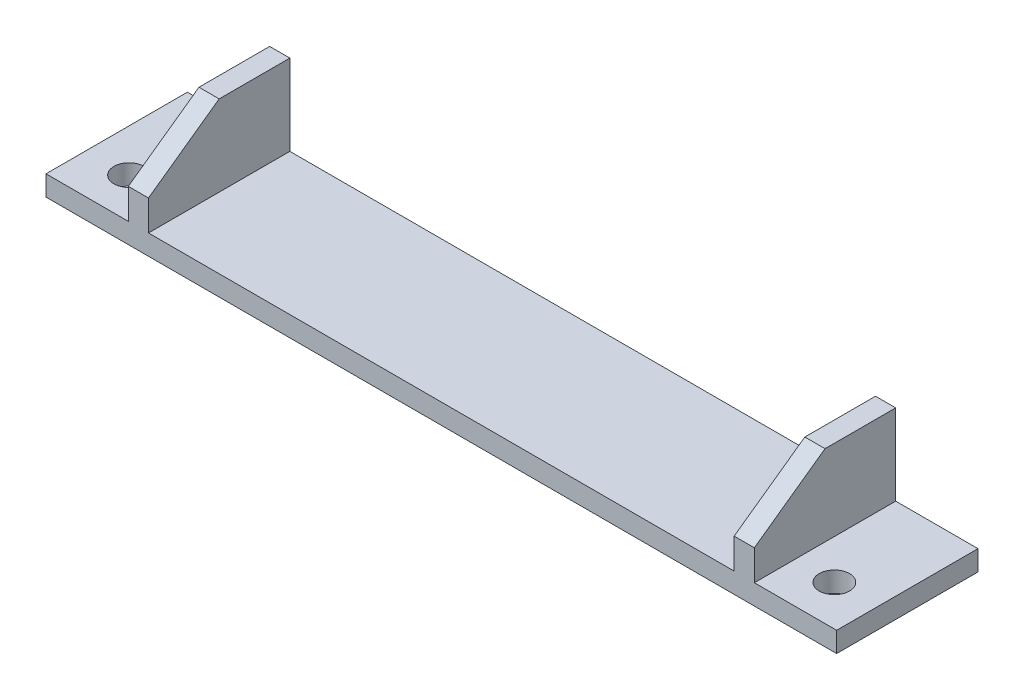
ISO-10303-21;
HEADER;
FILE_DESCRIPTION(('STEP AP214'),'2;1');
FILE_NAME('part.step','',(''),(''),'','','');
FILE_SCHEMA(('AUTOMOTIVE_DESIGN { 1 0 10303 214 1 1 1 1 }'));
ENDSEC;
DATA;
#1=APPLICATION_CONTEXT('core data for automotive mechanical design processes');
#2=APPLICATION_PROTOCOL_DEFINITION('international standard','automotive_design',2000,#1);
#3=PRODUCT_CONTEXT('',#1,'mechanical');
#4=PRODUCT('Part','Part','',(#3));
#5=PRODUCT_RELATED_PRODUCT_CATEGORY('part','',(#4));
#6=PRODUCT_DEFINITION_FORMATION('','',#4);
#7=PRODUCT_DEFINITION_CONTEXT('part definition',#1,'design');
#8=PRODUCT_DEFINITION('design','',#6,#7);
#9=PRODUCT_DEFINITION_SHAPE('','',#8);
#10=(LENGTH_UNIT() NAMED_UNIT(*) SI_UNIT(.MILLI.,.METRE.));
#11=(NAMED_UNIT(*) PLANE_ANGLE_UNIT() SI_UNIT($,.RADIAN.));
#12=(NAMED_UNIT(*) SI_UNIT($,.STERADIAN.) SOLID_ANGLE_UNIT());
#13=UNCERTAINTY_MEASURE_WITH_UNIT(LENGTH_MEASURE(1.E-05),#10,'distance_accuracy_value','');
#14=(GEOMETRIC_REPRESENTATION_CONTEXT(3) GLOBAL_UNCERTAINTY_ASSIGNED_CONTEXT((#13)) GLOBAL_UNIT_ASSIGNED_CONTEXT((#10,
#11,#12)) REPRESENTATION_CONTEXT('',''));
#15=CARTESIAN_POINT('',(0.,0.,0.));
#16=DIRECTION('',(0.,0.,1.));
#17=DIRECTION('',(1.,0.,0.));
#18=AXIS2_PLACEMENT_3D('',#15,#16,#17);
#19=CARTESIAN_POINT('',(0.,2.,0.));
#20=DIRECTION('',(0.,-1.,0.));
#21=DIRECTION('',(0.,0.,-1.));
#22=AXIS2_PLACEMENT_3D('',#19,#20,#21);
#23=PLANE('',#22);
#24=CARTESIAN_POINT('',(44.6246451696033,2.,-0.832823468273441));
#25=DIRECTION('',(0.,-1.,0.));
#26=DIRECTION('',(0.,0.,-1.));
#27=AXIS2_PLACEMENT_3D('',#24,#25,#26);
#28=CIRCLE('',#27,1.5);
#29=CARTESIAN_POINT('',(44.6246451696033,2.,-2.33282346827344));
#30=VERTEX_POINT('',#29);
#31=EDGE_CURVE('E293',#30,#30,#28,.T.);
#32=ORIENTED_EDGE('',*,*,#31,.T.);
#33=EDGE_LOOP('',(#32));
#34=FACE_BOUND('',#33,.T.);
#35=DIRECTION('',(0.,0.,-1.));
#36=VECTOR('',#35,1.);
#37=CARTESIAN_POINT('',(40.6996451696033,2.,-10.8328234682735));
#38=LINE('',#37,#36);
#39=CARTESIAN_POINT('',(40.6996451696033,2.,3.16717653172655));
#40=VERTEX_POINT('',#39);
#41=CARTESIAN_POINT('',(40.6996451696033,2.,-10.8328234682735));
#42=VERTEX_POINT('',#41);
#43=EDGE_CURVE('E224',#40,#42,#38,.T.);
#44=ORIENTED_EDGE('',*,*,#43,.F.);
#45=DIRECTION('',(1.,0.,0.));
#46=VECTOR('',#45,1.);
#47=CARTESIAN_POINT('',(-29.4503548303967,2.,3.16717653172655));
#48=LINE('',#47,#46);
#49=CARTESIAN_POINT('',(48.8496451696033,2.,3.16717653172654));
#50=VERTEX_POINT('',#49);
#51=EDGE_CURVE('E307',#40,#50,#48,.T.);
#52=ORIENTED_EDGE('',*,*,#51,.T.);
#53=DIRECTION('',(0.,0.,1.));
#54=VECTOR('',#53,1.);
#55=CARTESIAN_POINT('',(48.8496451696033,2.,-10.8328234682735));
#56=LINE('',#55,#54);
#57=CARTESIAN_POINT('',(48.8496451696033,2.,-10.8328234682735));
#58=VERTEX_POINT('',#57);
#59=EDGE_CURVE('E305',#58,#50,#56,.T.);
#60=ORIENTED_EDGE('',*,*,#59,.F.);
#61=DIRECTION('',(1.,0.,0.));
#62=VECTOR('',#61,1.);
#63=CARTESIAN_POINT('',(-29.4503548303967,2.,-10.8328234682734));
#64=LINE('',#63,#62);
#65=EDGE_CURVE('E310',#42,#58,#64,.T.);
#66=ORIENTED_EDGE('',*,*,#65,.F.);
#67=EDGE_LOOP('',(#44,#52,#60,#66));
#68=FACE_BOUND('',#67,.T.);
#69=ADVANCED_FACE('F43',(#34,#68),#23,.F.);
#70=DIRECTION('',(0.,0.,1.));
#71=VECTOR('',#70,1.);
#72=CARTESIAN_POINT('',(38.6996451696033,2.,-10.8328234682735));
#73=LINE('',#72,#71);
#74=CARTESIAN_POINT('',(38.6996451696033,2.,-10.8328234682735));
#75=VERTEX_POINT('',#74);
#76=CARTESIAN_POINT('',(38.6996451696033,2.,3.16717653172655));
#77=VERTEX_POINT('',#76);
#78=EDGE_CURVE('E369',#75,#77,#73,.T.);
#79=ORIENTED_EDGE('',*,*,#78,.F.);
#80=CARTESIAN_POINT('',(-19.3003548303967,2.,-10.8328234682734));
#81=VERTEX_POINT('',#80);
#82=EDGE_CURVE('E315',#81,#75,#64,.T.);
#83=ORIENTED_EDGE('',*,*,#82,.F.);
#84=DIRECTION('',(0.,0.,-1.));
#85=VECTOR('',#84,1.);
#86=CARTESIAN_POINT('',(-19.3003548303967,2.,-10.8328234682734));
#87=LINE('',#86,#85);
#88=CARTESIAN_POINT('',(-19.3003548303967,2.,3.16717653172655));
#89=VERTEX_POINT('',#88);
#90=EDGE_CURVE('E212',#89,#81,#87,.T.);
#91=ORIENTED_EDGE('',*,*,#90,.F.);
#92=EDGE_CURVE('E306',#89,#77,#48,.T.);
#93=ORIENTED_EDGE('',*,*,#92,.T.);
#94=EDGE_LOOP('',(#79,#83,#91,#93));
#95=FACE_BOUND('',#94,.T.);
#96=ADVANCED_FACE('F367',(#95),#23,.F.);
#97=CARTESIAN_POINT('',(-25.2253548303967,2.,-0.832823468273441));
#98=DIRECTION('',(0.,-1.,0.));
#99=DIRECTION('',(0.,0.,-1.));
#100=AXIS2_PLACEMENT_3D('',#97,#98,#99);
#101=CIRCLE('',#100,1.5);
#102=CARTESIAN_POINT('',(-25.2253548303967,2.,-2.33282346827344));
#103=VERTEX_POINT('',#102);
#104=EDGE_CURVE('E298',#103,#103,#101,.T.);
#105=ORIENTED_EDGE('',*,*,#104,.T.);
#106=EDGE_LOOP('',(#105));
#107=FACE_BOUND('',#106,.T.);
#108=DIRECTION('',(0.,0.,1.));
#109=VECTOR('',#108,1.);
#110=CARTESIAN_POINT('',(-21.3003548303967,2.,-10.8328234682734));
#111=LINE('',#110,#109);
#112=CARTESIAN_POINT('',(-21.3003548303967,2.,-10.8328234682734));
#113=VERTEX_POINT('',#112);
#114=CARTESIAN_POINT('',(-21.3003548303967,2.,3.16717653172655));
#115=VERTEX_POINT('',#114);
#116=EDGE_CURVE('E216',#113,#115,#111,.T.);
#117=ORIENTED_EDGE('',*,*,#116,.F.);
#118=CARTESIAN_POINT('',(-29.4503548303967,2.,-10.8328234682734));
#119=VERTEX_POINT('',#118);
#120=EDGE_CURVE('E311',#119,#113,#64,.T.);
#121=ORIENTED_EDGE('',*,*,#120,.F.);
#122=DIRECTION('',(0.,0.,1.));
#123=VECTOR('',#122,1.);
#124=CARTESIAN_POINT('',(-29.4503548303967,2.,-10.8328234682734));
#125=LINE('',#124,#123);
#126=CARTESIAN_POINT('',(-29.4503548303967,2.,3.16717653172655));
#127=VERTEX_POINT('',#126);
#128=EDGE_CURVE('E314',#119,#127,#125,.T.);
#129=ORIENTED_EDGE('',*,*,#128,.T.);
#130=EDGE_CURVE('E302',#127,#115,#48,.T.);
#131=ORIENTED_EDGE('',*,*,#130,.T.);
#132=EDGE_LOOP('',(#117,#121,#129,#131));
#133=FACE_BOUND('',#132,.T.);
#134=ADVANCED_FACE('F419',(#107,#133),#23,.F.);
#135=CARTESIAN_POINT('',(0.,0.,0.));
#136=DIRECTION('',(0.,-1.,0.));
#137=DIRECTION('',(0.,0.,-1.));
#138=AXIS2_PLACEMENT_3D('',#135,#136,#137);
#139=PLANE('',#138);
#140=CARTESIAN_POINT('',(-25.2253548303967,0.,-0.832823468273441));
#141=DIRECTION('',(0.,1.,0.));
#142=DIRECTION('',(0.,0.,1.));
#143=AXIS2_PLACEMENT_3D('',#140,#141,#142);
#144=CIRCLE('',#143,1.5);
#145=CARTESIAN_POINT('',(-25.2253548303967,0.,0.66717653172656));
#146=VERTEX_POINT('',#145);
#147=EDGE_CURVE('E290',#146,#146,#144,.T.);
#148=ORIENTED_EDGE('',*,*,#147,.T.);
#149=EDGE_LOOP('',(#148));
#150=FACE_BOUND('',#149,.T.);
#151=CARTESIAN_POINT('',(44.6246451696033,0.,-0.832823468273441));
#152=DIRECTION('',(0.,1.,0.));
#153=DIRECTION('',(0.,0.,1.));
#154=AXIS2_PLACEMENT_3D('',#151,#152,#153);
#155=CIRCLE('',#154,1.5);
#156=CARTESIAN_POINT('',(44.6246451696033,0.,0.667176531726563));
#157=VERTEX_POINT('',#156);
#158=EDGE_CURVE('E289',#157,#157,#155,.T.);
#159=ORIENTED_EDGE('',*,*,#158,.T.);
#160=EDGE_LOOP('',(#159));
#161=FACE_BOUND('',#160,.T.);
#162=DIRECTION('',(1.,0.,0.));
#163=VECTOR('',#162,1.);
#164=CARTESIAN_POINT('',(-29.4503548303967,0.,-10.8328234682734));
#165=LINE('',#164,#163);
#166=CARTESIAN_POINT('',(-9.50035483039672,0.,-10.8328234682734));
#167=VERTEX_POINT('',#166);
#168=CARTESIAN_POINT('',(28.8996451696033,0.,-10.8328234682734));
#169=VERTEX_POINT('',#168);
#170=EDGE_CURVE('E327',#167,#169,#165,.T.);
#171=ORIENTED_EDGE('',*,*,#170,.T.);
#172=DIRECTION('',(0.,0.,-1.));
#173=VECTOR('',#172,1.);
#174=CARTESIAN_POINT('',(28.8996451696033,0.,-10.8328234682734));
#175=LINE('',#174,#173);
#176=CARTESIAN_POINT('',(28.8996451696033,0.,-7.83282346827344));
#177=VERTEX_POINT('',#176);
#178=EDGE_CURVE('E249',#177,#169,#175,.T.);
#179=ORIENTED_EDGE('',*,*,#178,.F.);
#180=DIRECTION('',(-1.,0.,0.));
#181=VECTOR('',#180,1.);
#182=CARTESIAN_POINT('',(28.8996451696033,0.,-7.83282346827344));
#183=LINE('',#182,#181);
#184=CARTESIAN_POINT('',(31.8996451696033,0.,-7.83282346827344));
#185=VERTEX_POINT('',#184);
#186=EDGE_CURVE('E243',#185,#177,#183,.T.);
#187=ORIENTED_EDGE('',*,*,#186,.F.);
#188=DIRECTION('',(0.,0.,1.));
#189=VECTOR('',#188,1.);
#190=CARTESIAN_POINT('',(31.8996451696033,0.,-10.8328234682734));
#191=LINE('',#190,#189);
#192=CARTESIAN_POINT('',(31.8996451696033,0.,-10.8328234682734));
#193=VERTEX_POINT('',#192);
#194=EDGE_CURVE('E245',#193,#185,#191,.T.);
#195=ORIENTED_EDGE('',*,*,#194,.F.);
#196=CARTESIAN_POINT('',(48.8496451696033,0.,-10.8328234682735));
#197=VERTEX_POINT('',#196);
#198=EDGE_CURVE('E323',#193,#197,#165,.T.);
#199=ORIENTED_EDGE('',*,*,#198,.T.);
#200=DIRECTION('',(0.,0.,1.));
#201=VECTOR('',#200,1.);
#202=CARTESIAN_POINT('',(48.8496451696033,0.,-10.8328234682735));
#203=LINE('',#202,#201);
#204=CARTESIAN_POINT('',(48.8496451696033,0.,3.16717653172654));
#205=VERTEX_POINT('',#204);
#206=EDGE_CURVE('E320',#197,#205,#203,.T.);
#207=ORIENTED_EDGE('',*,*,#206,.T.);
#208=DIRECTION('',(1.,0.,0.));
#209=VECTOR('',#208,1.);
#210=CARTESIAN_POINT('',(-29.4503548303967,0.,3.16717653172655));
#211=LINE('',#210,#209);
#212=CARTESIAN_POINT('',(-29.4503548303967,0.,3.16717653172655));
#213=VERTEX_POINT('',#212);
#214=EDGE_CURVE('E301',#213,#205,#211,.T.);
#215=ORIENTED_EDGE('',*,*,#214,.F.);
#216=DIRECTION('',(0.,0.,1.));
#217=VECTOR('',#216,1.);
#218=CARTESIAN_POINT('',(-29.4503548303967,0.,-10.8328234682734));
#219=LINE('',#218,#217);
#220=CARTESIAN_POINT('',(-29.4503548303967,0.,-10.8328234682734));
#221=VERTEX_POINT('',#220);
#222=EDGE_CURVE('E326',#221,#213,#219,.T.);
#223=ORIENTED_EDGE('',*,*,#222,.F.);
#224=CARTESIAN_POINT('',(-12.5003548303967,0.,-10.8328234682734));
#225=VERTEX_POINT('',#224);
#226=EDGE_CURVE('E324',#221,#225,#165,.T.);
#227=ORIENTED_EDGE('',*,*,#226,.T.);
#228=DIRECTION('',(0.,0.,-1.));
#229=VECTOR('',#228,1.);
#230=CARTESIAN_POINT('',(-12.5003548303967,0.,-10.8328234682734));
#231=LINE('',#230,#229);
#232=CARTESIAN_POINT('',(-12.5003548303967,0.,-7.83282346827344));
#233=VERTEX_POINT('',#232);
#234=EDGE_CURVE('E264',#233,#225,#231,.T.);
#235=ORIENTED_EDGE('',*,*,#234,.F.);
#236=DIRECTION('',(-1.,0.,0.));
#237=VECTOR('',#236,1.);
#238=CARTESIAN_POINT('',(-9.50035483039672,0.,-7.83282346827344));
#239=LINE('',#238,#237);
#240=CARTESIAN_POINT('',(-9.50035483039672,0.,-7.83282346827344));
#241=VERTEX_POINT('',#240);
#242=EDGE_CURVE('E273',#241,#233,#239,.T.);
#243=ORIENTED_EDGE('',*,*,#242,.F.);
#244=DIRECTION('',(0.,0.,1.));
#245=VECTOR('',#244,1.);
#246=CARTESIAN_POINT('',(-9.50035483039672,0.,-10.8328234682734));
#247=LINE('',#246,#245);
#248=EDGE_CURVE('E252',#167,#241,#247,.T.);
#249=ORIENTED_EDGE('',*,*,#248,.F.);
#250=EDGE_LOOP('',(#171,#179,#187,#195,#199,#207,#215,#223,#227,#235,#243,#249));
#251=FACE_BOUND('',#250,.T.);
#252=ADVANCED_FACE('F350',(#150,#161,#251),#139,.T.);
#253=CARTESIAN_POINT('',(-29.4503548303967,2.,3.16717653172655));
#254=DIRECTION('',(0.,0.,-1.));
#255=DIRECTION('',(-1.,0.,0.));
#256=AXIS2_PLACEMENT_3D('',#253,#254,#255);
#257=PLANE('',#256);
#258=DIRECTION('',(0.,-1.,0.));
#259=VECTOR('',#258,1.);
#260=CARTESIAN_POINT('',(40.6996451696033,10.,3.16717653172655));
#261=LINE('',#260,#259);
#262=CARTESIAN_POINT('',(40.6996451696033,5.,3.16717653172655));
#263=VERTEX_POINT('',#262);
#264=EDGE_CURVE('E402',#263,#40,#261,.T.);
#265=ORIENTED_EDGE('',*,*,#264,.F.);
#266=DIRECTION('',(-1.,0.,0.));
#267=VECTOR('',#266,1.);
#268=CARTESIAN_POINT('',(48.8496451696033,5.,3.16717653172655));
#269=LINE('',#268,#267);
#270=CARTESIAN_POINT('',(38.6996451696033,5.,3.16717653172655));
#271=VERTEX_POINT('',#270);
#272=EDGE_CURVE('E375',#263,#271,#269,.T.);
#273=ORIENTED_EDGE('',*,*,#272,.T.);
#274=DIRECTION('',(0.,-1.,0.));
#275=VECTOR('',#274,1.);
#276=CARTESIAN_POINT('',(38.6996451696033,10.,3.16717653172655));
#277=LINE('',#276,#275);
#278=EDGE_CURVE('E374',#271,#77,#277,.T.);
#279=ORIENTED_EDGE('',*,*,#278,.T.);
#280=ORIENTED_EDGE('',*,*,#92,.F.);
#281=DIRECTION('',(0.,-1.,0.));
#282=VECTOR('',#281,1.);
#283=CARTESIAN_POINT('',(-19.3003548303967,10.,3.16717653172655));
#284=LINE('',#283,#282);
#285=CARTESIAN_POINT('',(-19.3003548303967,5.,3.16717653172655));
#286=VERTEX_POINT('',#285);
#287=EDGE_CURVE('E230',#286,#89,#284,.T.);
#288=ORIENTED_EDGE('',*,*,#287,.F.);
#289=CARTESIAN_POINT('',(-21.3003548303967,5.,3.16717653172655));
#290=VERTEX_POINT('',#289);
#291=EDGE_CURVE('E196',#286,#290,#269,.T.);
#292=ORIENTED_EDGE('',*,*,#291,.T.);
#293=DIRECTION('',(0.,-1.,0.));
#294=VECTOR('',#293,1.);
#295=CARTESIAN_POINT('',(-21.3003548303967,10.,3.16717653172655));
#296=LINE('',#295,#294);
#297=EDGE_CURVE('E205',#290,#115,#296,.T.);
#298=ORIENTED_EDGE('',*,*,#297,.T.);
#299=ORIENTED_EDGE('',*,*,#130,.F.);
#300=DIRECTION('',(0.,-1.,0.));
#301=VECTOR('',#300,1.);
#302=CARTESIAN_POINT('',(-29.4503548303967,2.,3.16717653172655));
#303=LINE('',#302,#301);
#304=EDGE_CURVE('E317',#127,#213,#303,.T.);
#305=ORIENTED_EDGE('',*,*,#304,.T.);
#306=ORIENTED_EDGE('',*,*,#214,.T.);
#307=DIRECTION('',(0.,-1.,0.));
#308=VECTOR('',#307,1.);
#309=CARTESIAN_POINT('',(48.8496451696033,2.,3.16717653172654));
#310=LINE('',#309,#308);
#311=EDGE_CURVE('E51',#50,#205,#310,.T.);
#312=ORIENTED_EDGE('',*,*,#311,.F.);
#313=ORIENTED_EDGE('',*,*,#51,.F.);
#314=EDGE_LOOP('',(#265,#273,#279,#280,#288,#292,#298,#299,#305,#306,#312,#313));
#315=FACE_BOUND('',#314,.T.);
#316=ADVANCED_FACE('F45',(#315),#257,.F.);
#317=CARTESIAN_POINT('',(48.8496451696033,2.,-10.8328234682735));
#318=DIRECTION('',(1.,0.,0.));
#319=DIRECTION('',(0.,0.,-1.));
#320=AXIS2_PLACEMENT_3D('',#317,#318,#319);
#321=PLANE('',#320);
#322=ORIENTED_EDGE('',*,*,#206,.F.);
#323=DIRECTION('',(0.,-1.,0.));
#324=VECTOR('',#323,1.);
#325=CARTESIAN_POINT('',(48.8496451696033,2.,-10.8328234682735));
#326=LINE('',#325,#324);
#327=EDGE_CURVE('E333',#58,#197,#326,.T.);
#328=ORIENTED_EDGE('',*,*,#327,.F.);
#329=ORIENTED_EDGE('',*,*,#59,.T.);
#330=ORIENTED_EDGE('',*,*,#311,.T.);
#331=EDGE_LOOP('',(#322,#328,#329,#330));
#332=FACE_BOUND('',#331,.T.);
#333=ADVANCED_FACE('F338',(#332),#321,.T.);
#334=CARTESIAN_POINT('',(-29.4503548303967,2.,-10.8328234682734));
#335=DIRECTION('',(0.,0.,-1.));
#336=DIRECTION('',(-1.,0.,0.));
#337=AXIS2_PLACEMENT_3D('',#334,#335,#336);
#338=PLANE('',#337);
#339=ORIENTED_EDGE('',*,*,#226,.F.);
#340=DIRECTION('',(0.,-1.,0.));
#341=VECTOR('',#340,1.);
#342=CARTESIAN_POINT('',(-29.4503548303967,2.,-10.8328234682734));
#343=LINE('',#342,#341);
#344=EDGE_CURVE('E331',#119,#221,#343,.T.);
#345=ORIENTED_EDGE('',*,*,#344,.F.);
#346=ORIENTED_EDGE('',*,*,#120,.T.);
#347=DIRECTION('',(0.,-1.,0.));
#348=VECTOR('',#347,1.);
#349=CARTESIAN_POINT('',(-21.3003548303967,10.,-10.8328234682734));
#350=LINE('',#349,#348);
#351=CARTESIAN_POINT('',(-21.3003548303967,10.,-10.8328234682734));
#352=VERTEX_POINT('',#351);
#353=EDGE_CURVE('E223',#352,#113,#350,.T.);
#354=ORIENTED_EDGE('',*,*,#353,.F.);
#355=DIRECTION('',(-1.,0.,0.));
#356=VECTOR('',#355,1.);
#357=CARTESIAN_POINT('',(-19.3003548303967,10.,-10.8328234682734));
#358=LINE('',#357,#356);
#359=CARTESIAN_POINT('',(-19.3003548303967,10.,-10.8328234682734));
#360=VERTEX_POINT('',#359);
#361=EDGE_CURVE('E209',#360,#352,#358,.T.);
#362=ORIENTED_EDGE('',*,*,#361,.F.);
#363=DIRECTION('',(0.,-1.,0.));
#364=VECTOR('',#363,1.);
#365=CARTESIAN_POINT('',(-19.3003548303967,10.,-10.8328234682734));
#366=LINE('',#365,#364);
#367=EDGE_CURVE('E227',#360,#81,#366,.T.);
#368=ORIENTED_EDGE('',*,*,#367,.T.);
#369=ORIENTED_EDGE('',*,*,#82,.T.);
#370=DIRECTION('',(0.,-1.,0.));
#371=VECTOR('',#370,1.);
#372=CARTESIAN_POINT('',(38.6996451696033,10.,-10.8328234682735));
#373=LINE('',#372,#371);
#374=CARTESIAN_POINT('',(38.6996451696033,10.,-10.8328234682735));
#375=VERTEX_POINT('',#374);
#376=EDGE_CURVE('E379',#375,#75,#373,.T.);
#377=ORIENTED_EDGE('',*,*,#376,.F.);
#378=DIRECTION('',(-1.,0.,0.));
#379=VECTOR('',#378,1.);
#380=CARTESIAN_POINT('',(38.6996451696033,10.,-10.8328234682735));
#381=LINE('',#380,#379);
#382=CARTESIAN_POINT('',(40.6996451696033,10.,-10.8328234682735));
#383=VERTEX_POINT('',#382);
#384=EDGE_CURVE('E386',#383,#375,#381,.T.);
#385=ORIENTED_EDGE('',*,*,#384,.F.);
#386=DIRECTION('',(0.,-1.,0.));
#387=VECTOR('',#386,1.);
#388=CARTESIAN_POINT('',(40.6996451696033,10.,-10.8328234682735));
#389=LINE('',#388,#387);
#390=EDGE_CURVE('E395',#383,#42,#389,.T.);
#391=ORIENTED_EDGE('',*,*,#390,.T.);
#392=ORIENTED_EDGE('',*,*,#65,.T.);
#393=ORIENTED_EDGE('',*,*,#327,.T.);
#394=ORIENTED_EDGE('',*,*,#198,.F.);
#395=DIRECTION('',(0.,1.,0.));
#396=VECTOR('',#395,1.);
#397=CARTESIAN_POINT('',(31.8996451696033,-2.,-10.8328234682734));
#398=LINE('',#397,#396);
#399=CARTESIAN_POINT('',(31.8996451696033,-2.,-10.8328234682734));
#400=VERTEX_POINT('',#399);
#401=EDGE_CURVE('E235',#400,#193,#398,.T.);
#402=ORIENTED_EDGE('',*,*,#401,.F.);
#403=DIRECTION('',(1.,0.,0.));
#404=VECTOR('',#403,1.);
#405=CARTESIAN_POINT('',(28.8996451696033,-2.,-10.8328234682734));
#406=LINE('',#405,#404);
#407=CARTESIAN_POINT('',(28.8996451696033,-2.,-10.8328234682734));
#408=VERTEX_POINT('',#407);
#409=EDGE_CURVE('E256',#408,#400,#406,.T.);
#410=ORIENTED_EDGE('',*,*,#409,.F.);
#411=DIRECTION('',(0.,1.,0.));
#412=VECTOR('',#411,1.);
#413=CARTESIAN_POINT('',(28.8996451696033,-2.,-10.8328234682734));
#414=LINE('',#413,#412);
#415=EDGE_CURVE('E233',#408,#169,#414,.T.);
#416=ORIENTED_EDGE('',*,*,#415,.T.);
#417=ORIENTED_EDGE('',*,*,#170,.F.);
#418=DIRECTION('',(0.,1.,0.));
#419=VECTOR('',#418,1.);
#420=CARTESIAN_POINT('',(-9.50035483039672,-2.,-10.8328234682734));
#421=LINE('',#420,#419);
#422=CARTESIAN_POINT('',(-9.50035483039672,-2.,-10.8328234682734));
#423=VERTEX_POINT('',#422);
#424=EDGE_CURVE('E270',#423,#167,#421,.T.);
#425=ORIENTED_EDGE('',*,*,#424,.F.);
#426=DIRECTION('',(1.,0.,0.));
#427=VECTOR('',#426,1.);
#428=CARTESIAN_POINT('',(-9.50035483039672,-2.,-10.8328234682734));
#429=LINE('',#428,#427);
#430=CARTESIAN_POINT('',(-12.5003548303967,-2.,-10.8328234682734));
#431=VERTEX_POINT('',#430);
#432=EDGE_CURVE('E268',#431,#423,#429,.T.);
#433=ORIENTED_EDGE('',*,*,#432,.F.);
#434=DIRECTION('',(0.,1.,0.));
#435=VECTOR('',#434,1.);
#436=CARTESIAN_POINT('',(-12.5003548303967,-2.,-10.8328234682734));
#437=LINE('',#436,#435);
#438=EDGE_CURVE('E280',#431,#225,#437,.T.);
#439=ORIENTED_EDGE('',*,*,#438,.T.);
#440=EDGE_LOOP('',(#339,#345,#346,#354,#362,#368,#369,#377,#385,#391,#392,#393,#394,#402,#410,
#416,#417,#425,#433,#439));
#441=FACE_BOUND('',#440,.T.);
#442=ADVANCED_FACE('F357',(#441),#338,.T.);
#443=CARTESIAN_POINT('',(-29.4503548303967,2.,-10.8328234682734));
#444=DIRECTION('',(1.,0.,0.));
#445=DIRECTION('',(0.,0.,-1.));
#446=AXIS2_PLACEMENT_3D('',#443,#444,#445);
#447=PLANE('',#446);
#448=ORIENTED_EDGE('',*,*,#222,.T.);
#449=ORIENTED_EDGE('',*,*,#304,.F.);
#450=ORIENTED_EDGE('',*,*,#128,.F.);
#451=ORIENTED_EDGE('',*,*,#344,.T.);
#452=EDGE_LOOP('',(#448,#449,#450,#451));
#453=FACE_BOUND('',#452,.T.);
#454=ADVANCED_FACE('F436',(#453),#447,.F.);
#455=CARTESIAN_POINT('',(44.6246451696033,0.,-0.832823468273441));
#456=DIRECTION('',(0.,1.,0.));
#457=DIRECTION('',(0.,0.,1.));
#458=AXIS2_PLACEMENT_3D('',#455,#456,#457);
#459=CYLINDRICAL_SURFACE('',#458,1.5);
#460=ORIENTED_EDGE('',*,*,#158,.F.);
#461=EDGE_LOOP('',(#460));
#462=FACE_BOUND('',#461,.T.);
#463=ORIENTED_EDGE('',*,*,#31,.F.);
#464=EDGE_LOOP('',(#463));
#465=FACE_BOUND('',#464,.T.);
#466=ADVANCED_FACE('F481',(#462,#465),#459,.F.);
#467=CARTESIAN_POINT('',(-25.2253548303967,0.,-0.832823468273441));
#468=DIRECTION('',(0.,1.,0.));
#469=DIRECTION('',(0.,0.,1.));
#470=AXIS2_PLACEMENT_3D('',#467,#468,#469);
#471=CYLINDRICAL_SURFACE('',#470,1.5);
#472=ORIENTED_EDGE('',*,*,#147,.F.);
#473=EDGE_LOOP('',(#472));
#474=FACE_BOUND('',#473,.T.);
#475=ORIENTED_EDGE('',*,*,#104,.F.);
#476=EDGE_LOOP('',(#475));
#477=FACE_BOUND('',#476,.T.);
#478=ADVANCED_FACE('F478',(#474,#477),#471,.F.);
#479=CARTESIAN_POINT('',(-9.50035483039672,-2.,-10.8328234682734));
#480=DIRECTION('',(-1.,0.,0.));
#481=DIRECTION('',(0.,0.,1.));
#482=AXIS2_PLACEMENT_3D('',#479,#480,#481);
#483=PLANE('',#482);
#484=ORIENTED_EDGE('',*,*,#248,.T.);
#485=DIRECTION('',(0.,1.,0.));
#486=VECTOR('',#485,1.);
#487=CARTESIAN_POINT('',(-9.50035483039672,-2.,-7.83282346827344));
#488=LINE('',#487,#486);
#489=CARTESIAN_POINT('',(-9.50035483039672,-2.,-7.83282346827344));
#490=VERTEX_POINT('',#489);
#491=EDGE_CURVE('E286',#490,#241,#488,.T.);
#492=ORIENTED_EDGE('',*,*,#491,.F.);
#493=DIRECTION('',(0.,0.,1.));
#494=VECTOR('',#493,1.);
#495=CARTESIAN_POINT('',(-9.50035483039672,-2.,-10.8328234682734));
#496=LINE('',#495,#494);
#497=EDGE_CURVE('E260',#423,#490,#496,.T.);
#498=ORIENTED_EDGE('',*,*,#497,.F.);
#499=ORIENTED_EDGE('',*,*,#424,.T.);
#500=EDGE_LOOP('',(#484,#492,#498,#499));
#501=FACE_BOUND('',#500,.T.);
#502=ADVANCED_FACE('F474',(#501),#483,.F.);
#503=CARTESIAN_POINT('',(-9.50035483039672,-2.,-7.83282346827344));
#504=DIRECTION('',(0.,0.,-1.));
#505=DIRECTION('',(-1.,0.,0.));
#506=AXIS2_PLACEMENT_3D('',#503,#504,#505);
#507=PLANE('',#506);
#508=ORIENTED_EDGE('',*,*,#242,.T.);
#509=DIRECTION('',(0.,1.,0.));
#510=VECTOR('',#509,1.);
#511=CARTESIAN_POINT('',(-12.5003548303967,-2.,-7.83282346827344));
#512=LINE('',#511,#510);
#513=CARTESIAN_POINT('',(-12.5003548303967,-2.,-7.83282346827344));
#514=VERTEX_POINT('',#513);
#515=EDGE_CURVE('E283',#514,#233,#512,.T.);
#516=ORIENTED_EDGE('',*,*,#515,.F.);
#517=DIRECTION('',(-1.,0.,0.));
#518=VECTOR('',#517,1.);
#519=CARTESIAN_POINT('',(-9.50035483039672,-2.,-7.83282346827344));
#520=LINE('',#519,#518);
#521=EDGE_CURVE('E263',#490,#514,#520,.T.);
#522=ORIENTED_EDGE('',*,*,#521,.F.);
#523=ORIENTED_EDGE('',*,*,#491,.T.);
#524=EDGE_LOOP('',(#508,#516,#522,#523));
#525=FACE_BOUND('',#524,.T.);
#526=ADVANCED_FACE('F470',(#525),#507,.F.);
#527=CARTESIAN_POINT('',(-12.5003548303967,-2.,-10.8328234682734));
#528=DIRECTION('',(1.,0.,0.));
#529=DIRECTION('',(0.,0.,-1.));
#530=AXIS2_PLACEMENT_3D('',#527,#528,#529);
#531=PLANE('',#530);
#532=ORIENTED_EDGE('',*,*,#234,.T.);
#533=ORIENTED_EDGE('',*,*,#438,.F.);
#534=DIRECTION('',(0.,0.,-1.));
#535=VECTOR('',#534,1.);
#536=CARTESIAN_POINT('',(-12.5003548303967,-2.,-10.8328234682734));
#537=LINE('',#536,#535);
#538=EDGE_CURVE('E266',#514,#431,#537,.T.);
#539=ORIENTED_EDGE('',*,*,#538,.F.);
#540=ORIENTED_EDGE('',*,*,#515,.T.);
#541=EDGE_LOOP('',(#532,#533,#539,#540));
#542=FACE_BOUND('',#541,.T.);
#543=ADVANCED_FACE('F466',(#542),#531,.F.);
#544=CARTESIAN_POINT('',(0.,-2.,0.));
#545=DIRECTION('',(0.,-1.,0.));
#546=DIRECTION('',(0.,0.,-1.));
#547=AXIS2_PLACEMENT_3D('',#544,#545,#546);
#548=PLANE('',#547);
#549=ORIENTED_EDGE('',*,*,#497,.T.);
#550=ORIENTED_EDGE('',*,*,#521,.T.);
#551=ORIENTED_EDGE('',*,*,#538,.T.);
#552=ORIENTED_EDGE('',*,*,#432,.T.);
#553=EDGE_LOOP('',(#549,#550,#551,#552));
#554=FACE_BOUND('',#553,.T.);
#555=ADVANCED_FACE('F452',(#554),#548,.T.);
#556=CARTESIAN_POINT('',(28.8996451696033,-2.,-10.8328234682734));
#557=DIRECTION('',(1.,0.,0.));
#558=DIRECTION('',(0.,0.,-1.));
#559=AXIS2_PLACEMENT_3D('',#556,#557,#558);
#560=PLANE('',#559);
#561=ORIENTED_EDGE('',*,*,#178,.T.);
#562=ORIENTED_EDGE('',*,*,#415,.F.);
#563=DIRECTION('',(0.,0.,-1.));
#564=VECTOR('',#563,1.);
#565=CARTESIAN_POINT('',(28.8996451696033,-2.,-10.8328234682734));
#566=LINE('',#565,#564);
#567=CARTESIAN_POINT('',(28.8996451696033,-2.,-7.83282346827344));
#568=VERTEX_POINT('',#567);
#569=EDGE_CURVE('E246',#568,#408,#566,.T.);
#570=ORIENTED_EDGE('',*,*,#569,.F.);
#571=DIRECTION('',(0.,1.,0.));
#572=VECTOR('',#571,1.);
#573=CARTESIAN_POINT('',(28.8996451696033,-2.,-7.83282346827344));
#574=LINE('',#573,#572);
#575=EDGE_CURVE('E239',#568,#177,#574,.T.);
#576=ORIENTED_EDGE('',*,*,#575,.T.);
#577=EDGE_LOOP('',(#561,#562,#570,#576));
#578=FACE_BOUND('',#577,.T.);
#579=ADVANCED_FACE('F448',(#578),#560,.F.);
#580=CARTESIAN_POINT('',(31.8996451696033,-2.,-10.8328234682734));
#581=DIRECTION('',(-1.,0.,0.));
#582=DIRECTION('',(0.,0.,1.));
#583=AXIS2_PLACEMENT_3D('',#580,#581,#582);
#584=PLANE('',#583);
#585=ORIENTED_EDGE('',*,*,#194,.T.);
#586=DIRECTION('',(0.,1.,0.));
#587=VECTOR('',#586,1.);
#588=CARTESIAN_POINT('',(31.8996451696033,-2.,-7.83282346827344));
#589=LINE('',#588,#587);
#590=CARTESIAN_POINT('',(31.8996451696033,-2.,-7.83282346827344));
#591=VERTEX_POINT('',#590);
#592=EDGE_CURVE('E237',#591,#185,#589,.T.);
#593=ORIENTED_EDGE('',*,*,#592,.F.);
#594=DIRECTION('',(0.,0.,1.));
#595=VECTOR('',#594,1.);
#596=CARTESIAN_POINT('',(31.8996451696033,-2.,-10.8328234682734));
#597=LINE('',#596,#595);
#598=EDGE_CURVE('E254',#400,#591,#597,.T.);
#599=ORIENTED_EDGE('',*,*,#598,.F.);
#600=ORIENTED_EDGE('',*,*,#401,.T.);
#601=EDGE_LOOP('',(#585,#593,#599,#600));
#602=FACE_BOUND('',#601,.T.);
#603=ADVANCED_FACE('F451',(#602),#584,.F.);
#604=CARTESIAN_POINT('',(28.8996451696033,-2.,-7.83282346827344));
#605=DIRECTION('',(0.,0.,-1.));
#606=DIRECTION('',(-1.,0.,0.));
#607=AXIS2_PLACEMENT_3D('',#604,#605,#606);
#608=PLANE('',#607);
#609=ORIENTED_EDGE('',*,*,#186,.T.);
#610=ORIENTED_EDGE('',*,*,#575,.F.);
#611=DIRECTION('',(-1.,0.,0.));
#612=VECTOR('',#611,1.);
#613=CARTESIAN_POINT('',(28.8996451696033,-2.,-7.83282346827344));
#614=LINE('',#613,#612);
#615=EDGE_CURVE('E242',#591,#568,#614,.T.);
#616=ORIENTED_EDGE('',*,*,#615,.F.);
#617=ORIENTED_EDGE('',*,*,#592,.T.);
#618=EDGE_LOOP('',(#609,#610,#616,#617));
#619=FACE_BOUND('',#618,.T.);
#620=ADVANCED_FACE('F456',(#619),#608,.F.);
#621=CARTESIAN_POINT('',(0.,-2.,0.));
#622=DIRECTION('',(0.,1.,0.));
#623=DIRECTION('',(0.,0.,1.));
#624=AXIS2_PLACEMENT_3D('',#621,#622,#623);
#625=PLANE('',#624);
#626=ORIENTED_EDGE('',*,*,#569,.T.);
#627=ORIENTED_EDGE('',*,*,#409,.T.);
#628=ORIENTED_EDGE('',*,*,#598,.T.);
#629=ORIENTED_EDGE('',*,*,#615,.T.);
#630=EDGE_LOOP('',(#626,#627,#628,#629));
#631=FACE_BOUND('',#630,.T.);
#632=ADVANCED_FACE('F444',(#631),#625,.F.);
#633=CARTESIAN_POINT('',(-21.3003548303967,10.,-10.8328234682734));
#634=DIRECTION('',(1.,0.,0.));
#635=DIRECTION('',(0.,0.,-1.));
#636=AXIS2_PLACEMENT_3D('',#633,#634,#635);
#637=PLANE('',#636);
#638=ORIENTED_EDGE('',*,*,#297,.F.);
#639=DIRECTION('',(0.,-0.581238193719096,0.813733471206735));
#640=VECTOR('',#639,1.);
#641=CARTESIAN_POINT('',(-21.3003548303967,5.,3.16717653172655));
#642=LINE('',#641,#640);
#643=CARTESIAN_POINT('',(-21.3003548303967,10.,-3.83282346827345));
#644=VERTEX_POINT('',#643);
#645=EDGE_CURVE('E191',#644,#290,#642,.T.);
#646=ORIENTED_EDGE('',*,*,#645,.F.);
#647=DIRECTION('',(0.,0.,1.));
#648=VECTOR('',#647,1.);
#649=CARTESIAN_POINT('',(-21.3003548303967,10.,-10.8328234682734));
#650=LINE('',#649,#648);
#651=EDGE_CURVE('E203',#352,#644,#650,.T.);
#652=ORIENTED_EDGE('',*,*,#651,.F.);
#653=ORIENTED_EDGE('',*,*,#353,.T.);
#654=ORIENTED_EDGE('',*,*,#116,.T.);
#655=EDGE_LOOP('',(#638,#646,#652,#653,#654));
#656=FACE_BOUND('',#655,.T.);
#657=ADVANCED_FACE('F201',(#656),#637,.F.);
#658=CARTESIAN_POINT('',(-19.3003548303967,10.,-10.8328234682734));
#659=DIRECTION('',(-1.,0.,0.));
#660=DIRECTION('',(0.,0.,1.));
#661=AXIS2_PLACEMENT_3D('',#658,#659,#660);
#662=PLANE('',#661);
#663=DIRECTION('',(0.,0.,-1.));
#664=VECTOR('',#663,1.);
#665=CARTESIAN_POINT('',(-19.3003548303967,10.,-10.8328234682734));
#666=LINE('',#665,#664);
#667=CARTESIAN_POINT('',(-19.3003548303967,10.,-3.83282346827345));
#668=VERTEX_POINT('',#667);
#669=EDGE_CURVE('E211',#668,#360,#666,.T.);
#670=ORIENTED_EDGE('',*,*,#669,.F.);
#671=DIRECTION('',(0.,-0.581238193719096,0.813733471206735));
#672=VECTOR('',#671,1.);
#673=CARTESIAN_POINT('',(-19.3003548303967,13.3108108108108,-8.46795860340858));
#674=LINE('',#673,#672);
#675=EDGE_CURVE('E58',#668,#286,#674,.T.);
#676=ORIENTED_EDGE('',*,*,#675,.T.);
#677=ORIENTED_EDGE('',*,*,#287,.T.);
#678=ORIENTED_EDGE('',*,*,#90,.T.);
#679=ORIENTED_EDGE('',*,*,#367,.F.);
#680=EDGE_LOOP('',(#670,#676,#677,#678,#679));
#681=FACE_BOUND('',#680,.T.);
#682=ADVANCED_FACE('F413',(#681),#662,.F.);
#683=CARTESIAN_POINT('',(0.,10.,0.));
#684=DIRECTION('',(0.,-1.,0.));
#685=DIRECTION('',(0.,0.,-1.));
#686=AXIS2_PLACEMENT_3D('',#683,#684,#685);
#687=PLANE('',#686);
#688=ORIENTED_EDGE('',*,*,#651,.T.);
#689=DIRECTION('',(-1.,0.,0.));
#690=VECTOR('',#689,1.);
#691=CARTESIAN_POINT('',(48.8496451696033,10.,-3.83282346827345));
#692=LINE('',#691,#690);
#693=EDGE_CURVE('E188',#668,#644,#692,.T.);
#694=ORIENTED_EDGE('',*,*,#693,.F.);
#695=ORIENTED_EDGE('',*,*,#669,.T.);
#696=ORIENTED_EDGE('',*,*,#361,.T.);
#697=EDGE_LOOP('',(#688,#694,#695,#696));
#698=FACE_BOUND('',#697,.T.);
#699=ADVANCED_FACE('F207',(#698),#687,.F.);
#700=CARTESIAN_POINT('',(40.6996451696033,10.,-10.8328234682735));
#701=DIRECTION('',(-1.,0.,0.));
#702=DIRECTION('',(0.,0.,1.));
#703=AXIS2_PLACEMENT_3D('',#700,#701,#702);
#704=PLANE('',#703);
#705=DIRECTION('',(0.,0.,-1.));
#706=VECTOR('',#705,1.);
#707=CARTESIAN_POINT('',(40.6996451696033,10.,-10.8328234682735));
#708=LINE('',#707,#706);
#709=CARTESIAN_POINT('',(40.6996451696033,10.,-3.83282346827345));
#710=VERTEX_POINT('',#709);
#711=EDGE_CURVE('E219',#710,#383,#708,.T.);
#712=ORIENTED_EDGE('',*,*,#711,.F.);
#713=DIRECTION('',(0.,-0.581238193719096,0.813733471206735));
#714=VECTOR('',#713,1.);
#715=CARTESIAN_POINT('',(40.6996451696033,13.3108108108108,-8.46795860340859));
#716=LINE('',#715,#714);
#717=EDGE_CURVE('E66',#710,#263,#716,.T.);
#718=ORIENTED_EDGE('',*,*,#717,.T.);
#719=ORIENTED_EDGE('',*,*,#264,.T.);
#720=ORIENTED_EDGE('',*,*,#43,.T.);
#721=ORIENTED_EDGE('',*,*,#390,.F.);
#722=EDGE_LOOP('',(#712,#718,#719,#720,#721));
#723=FACE_BOUND('',#722,.T.);
#724=ADVANCED_FACE('F405',(#723),#704,.F.);
#725=CARTESIAN_POINT('',(38.6996451696033,10.,-10.8328234682735));
#726=DIRECTION('',(1.,0.,0.));
#727=DIRECTION('',(0.,0.,-1.));
#728=AXIS2_PLACEMENT_3D('',#725,#726,#727);
#729=PLANE('',#728);
#730=ORIENTED_EDGE('',*,*,#278,.F.);
#731=DIRECTION('',(0.,0.581238193719096,-0.813733471206735));
#732=VECTOR('',#731,1.);
#733=CARTESIAN_POINT('',(38.6996451696033,13.3108108108108,-8.46795860340859));
#734=LINE('',#733,#732);
#735=CARTESIAN_POINT('',(38.6996451696033,10.,-3.83282346827345));
#736=VERTEX_POINT('',#735);
#737=EDGE_CURVE('E396',#271,#736,#734,.T.);
#738=ORIENTED_EDGE('',*,*,#737,.T.);
#739=DIRECTION('',(0.,0.,1.));
#740=VECTOR('',#739,1.);
#741=CARTESIAN_POINT('',(38.6996451696033,10.,-10.8328234682735));
#742=LINE('',#741,#740);
#743=EDGE_CURVE('E378',#375,#736,#742,.T.);
#744=ORIENTED_EDGE('',*,*,#743,.F.);
#745=ORIENTED_EDGE('',*,*,#376,.T.);
#746=ORIENTED_EDGE('',*,*,#78,.T.);
#747=EDGE_LOOP('',(#730,#738,#744,#745,#746));
#748=FACE_BOUND('',#747,.T.);
#749=ADVANCED_FACE('F381',(#748),#729,.F.);
#750=CARTESIAN_POINT('',(0.,10.,0.));
#751=DIRECTION('',(0.,-1.,0.));
#752=DIRECTION('',(0.,0.,-1.));
#753=AXIS2_PLACEMENT_3D('',#750,#751,#752);
#754=PLANE('',#753);
#755=ORIENTED_EDGE('',*,*,#743,.T.);
#756=DIRECTION('',(1.,0.,0.));
#757=VECTOR('',#756,1.);
#758=CARTESIAN_POINT('',(0.,10.,-3.83282346827345));
#759=LINE('',#758,#757);
#760=EDGE_CURVE('E11',#736,#710,#759,.T.);
#761=ORIENTED_EDGE('',*,*,#760,.T.);
#762=ORIENTED_EDGE('',*,*,#711,.T.);
#763=ORIENTED_EDGE('',*,*,#384,.T.);
#764=EDGE_LOOP('',(#755,#761,#762,#763));
#765=FACE_BOUND('',#764,.T.);
#766=ADVANCED_FACE('F392',(#765),#754,.F.);
#767=CARTESIAN_POINT('',(48.8496451696033,5.,3.16717653172655));
#768=DIRECTION('',(0.,-0.813733471206735,-0.581238193719096));
#769=DIRECTION('',(0.,0.581238193719096,-0.813733471206735));
#770=AXIS2_PLACEMENT_3D('',#767,#768,#769);
#771=PLANE('',#770);
#772=ORIENTED_EDGE('',*,*,#760,.F.);
#773=ORIENTED_EDGE('',*,*,#737,.F.);
#774=ORIENTED_EDGE('',*,*,#272,.F.);
#775=ORIENTED_EDGE('',*,*,#717,.F.);
#776=EDGE_LOOP('',(#772,#773,#774,#775));
#777=FACE_BOUND('',#776,.T.);
#778=ADVANCED_FACE('F638',(#777),#771,.F.);
#779=ORIENTED_EDGE('',*,*,#693,.T.);
#780=ORIENTED_EDGE('',*,*,#645,.T.);
#781=ORIENTED_EDGE('',*,*,#291,.F.);
#782=ORIENTED_EDGE('',*,*,#675,.F.);
#783=EDGE_LOOP('',(#779,#780,#781,#782));
#784=FACE_BOUND('',#783,.T.);
#785=ADVANCED_FACE('F190',(#784),#771,.F.);
#786=CLOSED_SHELL('',(#69,#96,#134,#252,#316,#333,#442,#454,#466,#478,#502,#526,#543,#555,#579,
#603,#620,#632,#657,#682,#699,#724,#749,#766,#778,#785));
#787=MANIFOLD_SOLID_BREP('B2',#786);
#788=ADVANCED_BREP_SHAPE_REPRESENTATION('',(#18,#787),#14);
#789=SHAPE_DEFINITION_REPRESENTATION(#9,#788);
ENDSEC;
END-ISO-10303-21;
